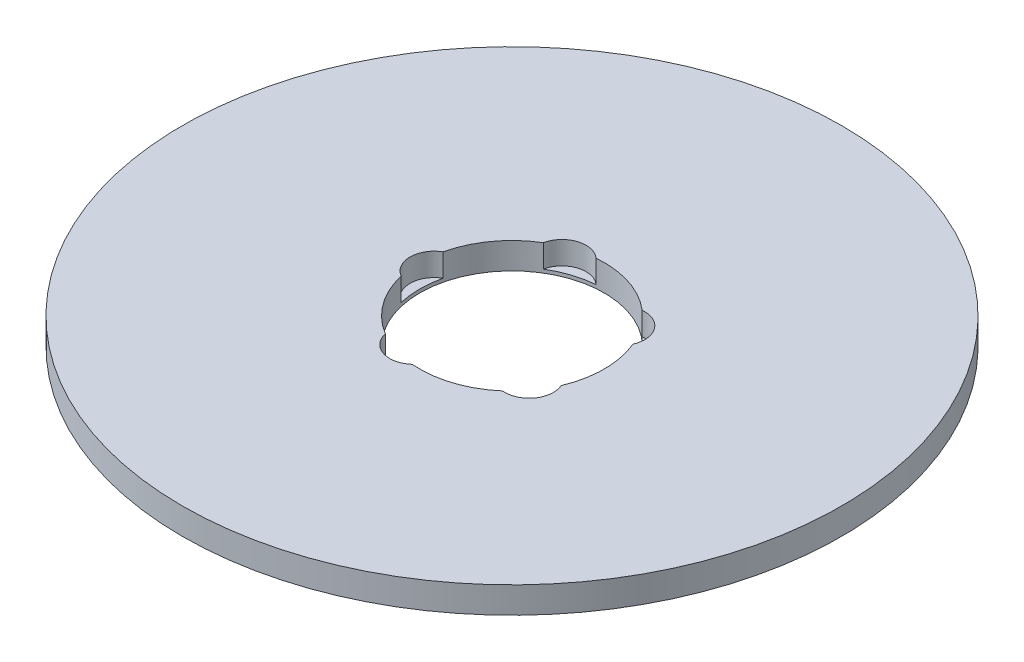
ISO-10303-21;
HEADER;
FILE_DESCRIPTION(('STEP AP214'),'2;1');
FILE_NAME('part.step','',(''),(''),'','','');
FILE_SCHEMA(('AUTOMOTIVE_DESIGN { 1 0 10303 214 1 1 1 1 }'));
ENDSEC;
DATA;
#1=APPLICATION_CONTEXT('core data for automotive mechanical design processes');
#2=APPLICATION_PROTOCOL_DEFINITION('international standard','automotive_design',2000,#1);
#3=PRODUCT_CONTEXT('',#1,'mechanical');
#4=PRODUCT('Part','Part','',(#3));
#5=PRODUCT_RELATED_PRODUCT_CATEGORY('part','',(#4));
#6=PRODUCT_DEFINITION_FORMATION('','',#4);
#7=PRODUCT_DEFINITION_CONTEXT('part definition',#1,'design');
#8=PRODUCT_DEFINITION('design','',#6,#7);
#9=PRODUCT_DEFINITION_SHAPE('','',#8);
#10=(LENGTH_UNIT() NAMED_UNIT(*) SI_UNIT(.MILLI.,.METRE.));
#11=(NAMED_UNIT(*) PLANE_ANGLE_UNIT() SI_UNIT($,.RADIAN.));
#12=(NAMED_UNIT(*) SI_UNIT($,.STERADIAN.) SOLID_ANGLE_UNIT());
#13=UNCERTAINTY_MEASURE_WITH_UNIT(LENGTH_MEASURE(1.E-05),#10,'distance_accuracy_value','');
#14=(GEOMETRIC_REPRESENTATION_CONTEXT(3) GLOBAL_UNCERTAINTY_ASSIGNED_CONTEXT((#13)) GLOBAL_UNIT_ASSIGNED_CONTEXT((#10,
#11,#12)) REPRESENTATION_CONTEXT('',''));
#15=CARTESIAN_POINT('',(0.,0.,0.));
#16=DIRECTION('',(0.,0.,1.));
#17=DIRECTION('',(1.,0.,0.));
#18=AXIS2_PLACEMENT_3D('',#15,#16,#17);
#19=CARTESIAN_POINT('',(0.,5.,0.));
#20=DIRECTION('',(0.,-1.,0.));
#21=DIRECTION('',(0.,0.,-1.));
#22=AXIS2_PLACEMENT_3D('',#19,#20,#21);
#23=CYLINDRICAL_SURFACE('',#22,62.5);
#24=CARTESIAN_POINT('',(0.,5.,0.));
#25=DIRECTION('',(0.,1.,0.));
#26=DIRECTION('',(0.,0.,1.));
#27=AXIS2_PLACEMENT_3D('',#24,#25,#26);
#28=CIRCLE('',#27,62.5);
#29=CARTESIAN_POINT('',(0.,5.,62.5));
#30=VERTEX_POINT('',#29);
#31=EDGE_CURVE('E151',#30,#30,#28,.T.);
#32=ORIENTED_EDGE('',*,*,#31,.F.);
#33=EDGE_LOOP('',(#32));
#34=FACE_BOUND('',#33,.T.);
#35=CARTESIAN_POINT('',(0.,0.,0.));
#36=DIRECTION('',(0.,1.,0.));
#37=DIRECTION('',(0.,0.,1.));
#38=AXIS2_PLACEMENT_3D('',#35,#36,#37);
#39=CIRCLE('',#38,62.5);
#40=CARTESIAN_POINT('',(0.,0.,62.5));
#41=VERTEX_POINT('',#40);
#42=EDGE_CURVE('E150',#41,#41,#39,.T.);
#43=ORIENTED_EDGE('',*,*,#42,.T.);
#44=EDGE_LOOP('',(#43));
#45=FACE_BOUND('',#44,.T.);
#46=ADVANCED_FACE('F39',(#34,#45),#23,.T.);
#47=CARTESIAN_POINT('',(0.,5.,0.));
#48=DIRECTION('',(0.,1.,0.));
#49=DIRECTION('',(0.,0.,1.));
#50=AXIS2_PLACEMENT_3D('',#47,#48,#49);
#51=PLANE('',#50);
#52=CARTESIAN_POINT('',(-4.55789758670267,5.,-14.0277663667251));
#53=DIRECTION('',(0.,1.,0.));
#54=DIRECTION('',(-0.95105651629515,0.,0.309016994374958));
#55=AXIS2_PLACEMENT_3D('',#52,#53,#54);
#56=CIRCLE('',#55,4.58566396211919);
#57=CARTESIAN_POINT('',(-1.49042088561762,5.,-17.4364172232634));
#58=VERTEX_POINT('',#57);
#59=CARTESIAN_POINT('',(-9.043093071417,5.,-14.9824052709066));
#60=VERTEX_POINT('',#59);
#61=EDGE_CURVE('E196',#58,#60,#56,.T.);
#62=ORIENTED_EDGE('',*,*,#61,.F.);
#63=CARTESIAN_POINT('',(0.,5.,0.));
#64=DIRECTION('',(0.,1.,0.));
#65=DIRECTION('',(0.,0.,1.));
#66=AXIS2_PLACEMENT_3D('',#63,#64,#65);
#67=CIRCLE('',#66,17.5);
#68=CARTESIAN_POINT('',(11.4546447218884,5.,-13.2303104383576));
#69=VERTEX_POINT('',#68);
#70=EDGE_CURVE('E156',#69,#58,#67,.T.);
#71=ORIENTED_EDGE('',*,*,#70,.F.);
#72=CARTESIAN_POINT('',(11.9327307992282,5.,-8.66963640087886));
#73=DIRECTION('',(0.,1.,0.));
#74=DIRECTION('',(-0.58778525229248,0.,-0.809016994374942));
#75=AXIS2_PLACEMENT_3D('',#72,#73,#74);
#76=CIRCLE('',#75,4.58566396211919);
#77=CARTESIAN_POINT('',(16.1224528385985,5.,-6.8056237382894));
#78=VERTEX_POINT('',#77);
#79=EDGE_CURVE('E254',#78,#69,#76,.T.);
#80=ORIENTED_EDGE('',*,*,#79,.F.);
#81=CARTESIAN_POINT('',(16.1224528385986,5.,6.80562373828917));
#82=VERTEX_POINT('',#81);
#83=EDGE_CURVE('E153',#82,#78,#67,.T.);
#84=ORIENTED_EDGE('',*,*,#83,.F.);
#85=CARTESIAN_POINT('',(11.9327307992283,5.,8.66963640087869));
#86=DIRECTION('',(0.,1.,0.));
#87=DIRECTION('',(0.587785252292469,0.,-0.809016994374951));
#88=AXIS2_PLACEMENT_3D('',#85,#86,#87);
#89=CIRCLE('',#88,4.58566396211919);
#90=CARTESIAN_POINT('',(11.4546447218886,5.,13.2303104383574));
#91=VERTEX_POINT('',#90);
#92=EDGE_CURVE('E248',#91,#82,#89,.T.);
#93=ORIENTED_EDGE('',*,*,#92,.F.);
#94=CARTESIAN_POINT('',(-1.49042088561737,5.,17.4364172232634));
#95=VERTEX_POINT('',#94);
#96=EDGE_CURVE('E140',#95,#91,#67,.T.);
#97=ORIENTED_EDGE('',*,*,#96,.F.);
#98=CARTESIAN_POINT('',(-4.55789758670247,5.,14.0277663667252));
#99=DIRECTION('',(0.,1.,0.));
#100=DIRECTION('',(0.951056516295155,0.,0.309016994374945));
#101=AXIS2_PLACEMENT_3D('',#98,#99,#100);
#102=CIRCLE('',#101,4.58566396211919);
#103=CARTESIAN_POINT('',(-9.04309307141679,5.,14.9824052709067));
#104=VERTEX_POINT('',#103);
#105=EDGE_CURVE('E117',#104,#95,#102,.T.);
#106=ORIENTED_EDGE('',*,*,#105,.F.);
#107=CARTESIAN_POINT('',(-17.0435836034528,5.,3.97067474771157));
#108=VERTEX_POINT('',#107);
#109=EDGE_CURVE('E133',#108,#104,#67,.T.);
#110=ORIENTED_EDGE('',*,*,#109,.F.);
#111=CARTESIAN_POINT('',(-14.7496664250516,5.,0.));
#112=DIRECTION('',(0.,1.,0.));
#113=DIRECTION('',(0.,0.,1.));
#114=AXIS2_PLACEMENT_3D('',#111,#112,#113);
#115=CIRCLE('',#114,4.58566396211919);
#116=CARTESIAN_POINT('',(-17.0435836034528,5.,-3.97067474771157));
#117=VERTEX_POINT('',#116);
#118=EDGE_CURVE('E170',#117,#108,#115,.T.);
#119=ORIENTED_EDGE('',*,*,#118,.F.);
#120=EDGE_CURVE('E149',#60,#117,#67,.T.);
#121=ORIENTED_EDGE('',*,*,#120,.F.);
#122=EDGE_LOOP('',(#62,#71,#80,#84,#93,#97,#106,#110,#119,#121));
#123=FACE_BOUND('',#122,.T.);
#124=ORIENTED_EDGE('',*,*,#31,.T.);
#125=EDGE_LOOP('',(#124));
#126=FACE_BOUND('',#125,.T.);
#127=ADVANCED_FACE('F131',(#123,#126),#51,.T.);
#128=CARTESIAN_POINT('',(0.,0.,0.));
#129=DIRECTION('',(0.,1.,0.));
#130=DIRECTION('',(0.,0.,1.));
#131=AXIS2_PLACEMENT_3D('',#128,#129,#130);
#132=PLANE('',#131);
#133=CARTESIAN_POINT('',(0.,0.,0.));
#134=DIRECTION('',(0.,1.,0.));
#135=DIRECTION('',(0.,0.,1.));
#136=AXIS2_PLACEMENT_3D('',#133,#134,#135);
#137=CIRCLE('',#136,17.5);
#138=CARTESIAN_POINT('',(0.,0.,17.5));
#139=VERTEX_POINT('',#138);
#140=EDGE_CURVE('E160',#139,#139,#137,.T.);
#141=ORIENTED_EDGE('',*,*,#140,.T.);
#142=EDGE_LOOP('',(#141));
#143=FACE_BOUND('',#142,.T.);
#144=ORIENTED_EDGE('',*,*,#42,.F.);
#145=EDGE_LOOP('',(#144));
#146=FACE_BOUND('',#145,.T.);
#147=ADVANCED_FACE('F212',(#143,#146),#132,.F.);
#148=CARTESIAN_POINT('',(0.,5.,0.));
#149=DIRECTION('',(0.,-1.,0.));
#150=DIRECTION('',(0.,0.,-1.));
#151=AXIS2_PLACEMENT_3D('',#148,#149,#150);
#152=CYLINDRICAL_SURFACE('',#151,17.5);
#153=DIRECTION('',(0.,1.,0.));
#154=VECTOR('',#153,1.);
#155=CARTESIAN_POINT('',(-1.49042088561762,2.82802596181678,-17.4364172232634));
#156=LINE('',#155,#154);
#157=CARTESIAN_POINT('',(-1.49042088561762,0.656051923633559,-17.4364172232634));
#158=VERTEX_POINT('',#157);
#159=EDGE_CURVE('E11',#158,#58,#156,.T.);
#160=ORIENTED_EDGE('',*,*,#159,.F.);
#161=CARTESIAN_POINT('',(0.,0.656051923633559,0.));
#162=DIRECTION('',(0.,1.,0.));
#163=DIRECTION('',(0.,0.,1.));
#164=AXIS2_PLACEMENT_3D('',#161,#162,#163);
#165=CIRCLE('',#164,17.5);
#166=CARTESIAN_POINT('',(-9.043093071417,0.656051923633559,-14.9824052709066));
#167=VERTEX_POINT('',#166);
#168=EDGE_CURVE('E193',#158,#167,#165,.T.);
#169=ORIENTED_EDGE('',*,*,#168,.T.);
#170=DIRECTION('',(0.,1.,0.));
#171=VECTOR('',#170,1.);
#172=CARTESIAN_POINT('',(-9.043093071417,2.82802596181678,-14.9824052709066));
#173=LINE('',#172,#171);
#174=EDGE_CURVE('E46',#60,#167,#173,.F.);
#175=ORIENTED_EDGE('',*,*,#174,.F.);
#176=ORIENTED_EDGE('',*,*,#120,.T.);
#177=DIRECTION('',(0.,1.,0.));
#178=VECTOR('',#177,1.);
#179=CARTESIAN_POINT('',(-17.0435836034528,2.82802596181678,-3.97067474771157));
#180=LINE('',#179,#178);
#181=CARTESIAN_POINT('',(-17.0435836034528,0.656051923633559,-3.97067474771157));
#182=VERTEX_POINT('',#181);
#183=EDGE_CURVE('E174',#182,#117,#180,.T.);
#184=ORIENTED_EDGE('',*,*,#183,.F.);
#185=CARTESIAN_POINT('',(0.,0.656051923633559,0.));
#186=DIRECTION('',(0.,1.,0.));
#187=DIRECTION('',(0.,0.,1.));
#188=AXIS2_PLACEMENT_3D('',#185,#186,#187);
#189=CIRCLE('',#188,17.5);
#190=CARTESIAN_POINT('',(-17.0435836034528,0.656051923633559,3.97067474771157));
#191=VERTEX_POINT('',#190);
#192=EDGE_CURVE('E171',#182,#191,#189,.T.);
#193=ORIENTED_EDGE('',*,*,#192,.T.);
#194=DIRECTION('',(0.,1.,0.));
#195=VECTOR('',#194,1.);
#196=CARTESIAN_POINT('',(-17.0435836034528,2.82802596181678,3.97067474771157));
#197=LINE('',#196,#195);
#198=EDGE_CURVE('E148',#108,#191,#197,.F.);
#199=ORIENTED_EDGE('',*,*,#198,.F.);
#200=ORIENTED_EDGE('',*,*,#109,.T.);
#201=DIRECTION('',(0.,1.,0.));
#202=VECTOR('',#201,1.);
#203=CARTESIAN_POINT('',(-9.04309307141679,2.82802596181678,14.9824052709067));
#204=LINE('',#203,#202);
#205=CARTESIAN_POINT('',(-9.04309307141679,0.656051923633559,14.9824052709067));
#206=VERTEX_POINT('',#205);
#207=EDGE_CURVE('E111',#206,#104,#204,.T.);
#208=ORIENTED_EDGE('',*,*,#207,.F.);
#209=CARTESIAN_POINT('',(0.,0.656051923633559,0.));
#210=DIRECTION('',(0.,1.,0.));
#211=DIRECTION('',(0.,0.,1.));
#212=AXIS2_PLACEMENT_3D('',#209,#210,#211);
#213=CIRCLE('',#212,17.5);
#214=CARTESIAN_POINT('',(-1.49042088561737,0.656051923633559,17.4364172232634));
#215=VERTEX_POINT('',#214);
#216=EDGE_CURVE('E180',#206,#215,#213,.T.);
#217=ORIENTED_EDGE('',*,*,#216,.T.);
#218=DIRECTION('',(0.,1.,0.));
#219=VECTOR('',#218,1.);
#220=CARTESIAN_POINT('',(-1.49042088561737,2.82802596181678,17.4364172232634));
#221=LINE('',#220,#219);
#222=EDGE_CURVE('E124',#95,#215,#221,.F.);
#223=ORIENTED_EDGE('',*,*,#222,.F.);
#224=ORIENTED_EDGE('',*,*,#96,.T.);
#225=DIRECTION('',(0.,1.,0.));
#226=VECTOR('',#225,1.);
#227=CARTESIAN_POINT('',(11.4546447218886,2.82802596181678,13.2303104383574));
#228=LINE('',#227,#226);
#229=CARTESIAN_POINT('',(11.4546447218886,0.656051923633559,13.2303104383574));
#230=VERTEX_POINT('',#229);
#231=EDGE_CURVE('E183',#230,#91,#228,.T.);
#232=ORIENTED_EDGE('',*,*,#231,.F.);
#233=CARTESIAN_POINT('',(0.,0.656051923633559,0.));
#234=DIRECTION('',(0.,1.,0.));
#235=DIRECTION('',(0.,0.,1.));
#236=AXIS2_PLACEMENT_3D('',#233,#234,#235);
#237=CIRCLE('',#236,17.5);
#238=CARTESIAN_POINT('',(16.1224528385986,0.656051923633559,6.80562373828917));
#239=VERTEX_POINT('',#238);
#240=EDGE_CURVE('E123',#230,#239,#237,.T.);
#241=ORIENTED_EDGE('',*,*,#240,.T.);
#242=DIRECTION('',(0.,1.,0.));
#243=VECTOR('',#242,1.);
#244=CARTESIAN_POINT('',(16.1224528385986,2.82802596181678,6.80562373828917));
#245=LINE('',#244,#243);
#246=EDGE_CURVE('E185',#82,#239,#245,.F.);
#247=ORIENTED_EDGE('',*,*,#246,.F.);
#248=ORIENTED_EDGE('',*,*,#83,.T.);
#249=DIRECTION('',(0.,1.,0.));
#250=VECTOR('',#249,1.);
#251=CARTESIAN_POINT('',(16.1224528385985,2.82802596181678,-6.80562373828941));
#252=LINE('',#251,#250);
#253=CARTESIAN_POINT('',(16.1224528385985,0.656051923633559,-6.8056237382894));
#254=VERTEX_POINT('',#253);
#255=EDGE_CURVE('E195',#254,#78,#252,.T.);
#256=ORIENTED_EDGE('',*,*,#255,.F.);
#257=CARTESIAN_POINT('',(0.,0.656051923633559,0.));
#258=DIRECTION('',(0.,1.,0.));
#259=DIRECTION('',(0.,0.,1.));
#260=AXIS2_PLACEMENT_3D('',#257,#258,#259);
#261=CIRCLE('',#260,17.5);
#262=CARTESIAN_POINT('',(11.4546447218884,0.656051923633559,-13.2303104383576));
#263=VERTEX_POINT('',#262);
#264=EDGE_CURVE('E190',#254,#263,#261,.T.);
#265=ORIENTED_EDGE('',*,*,#264,.T.);
#266=DIRECTION('',(0.,1.,0.));
#267=VECTOR('',#266,1.);
#268=CARTESIAN_POINT('',(11.4546447218884,2.82802596181678,-13.2303104383576));
#269=LINE('',#268,#267);
#270=EDGE_CURVE('E189',#69,#263,#269,.F.);
#271=ORIENTED_EDGE('',*,*,#270,.F.);
#272=ORIENTED_EDGE('',*,*,#70,.T.);
#273=EDGE_LOOP('',(#160,#169,#175,#176,#184,#193,#199,#200,#208,#217,#223,#224,#232,#241,#247,
#248,#256,#265,#271,#272));
#274=FACE_BOUND('',#273,.T.);
#275=ORIENTED_EDGE('',*,*,#140,.F.);
#276=EDGE_LOOP('',(#275));
#277=FACE_BOUND('',#276,.T.);
#278=ADVANCED_FACE('F142',(#274,#277),#152,.F.);
#279=CARTESIAN_POINT('',(-14.7496664250516,0.656051923633559,0.));
#280=DIRECTION('',(0.,1.,0.));
#281=DIRECTION('',(0.,0.,1.));
#282=AXIS2_PLACEMENT_3D('',#279,#280,#281);
#283=CYLINDRICAL_SURFACE('',#282,4.58566396211919);
#284=ORIENTED_EDGE('',*,*,#183,.T.);
#285=ORIENTED_EDGE('',*,*,#118,.T.);
#286=ORIENTED_EDGE('',*,*,#198,.T.);
#287=CARTESIAN_POINT('',(-14.7496664250516,0.656051923633559,0.));
#288=DIRECTION('',(0.,1.,0.));
#289=DIRECTION('',(0.,0.,1.));
#290=AXIS2_PLACEMENT_3D('',#287,#288,#289);
#291=CIRCLE('',#290,4.58566396211919);
#292=EDGE_CURVE('E163',#182,#191,#291,.T.);
#293=ORIENTED_EDGE('',*,*,#292,.F.);
#294=EDGE_LOOP('',(#284,#285,#286,#293));
#295=FACE_BOUND('',#294,.T.);
#296=ADVANCED_FACE('F221',(#295),#283,.F.);
#297=CARTESIAN_POINT('',(-14.7496664250516,0.656051923633559,0.));
#298=DIRECTION('',(0.,1.,0.));
#299=DIRECTION('',(0.,0.,1.));
#300=AXIS2_PLACEMENT_3D('',#297,#298,#299);
#301=PLANE('',#300);
#302=ORIENTED_EDGE('',*,*,#292,.T.);
#303=ORIENTED_EDGE('',*,*,#192,.F.);
#304=EDGE_LOOP('',(#302,#303));
#305=FACE_BOUND('',#304,.T.);
#306=ADVANCED_FACE('F227',(#305),#301,.T.);
#307=CARTESIAN_POINT('',(-4.55789758670247,0.656051923633559,14.0277663667252));
#308=DIRECTION('',(0.,1.,0.));
#309=DIRECTION('',(0.,0.,1.));
#310=AXIS2_PLACEMENT_3D('',#307,#308,#309);
#311=CYLINDRICAL_SURFACE('',#310,4.58566396211919);
#312=ORIENTED_EDGE('',*,*,#207,.T.);
#313=ORIENTED_EDGE('',*,*,#105,.T.);
#314=ORIENTED_EDGE('',*,*,#222,.T.);
#315=CARTESIAN_POINT('',(-4.55789758670247,0.656051923633559,14.0277663667252));
#316=DIRECTION('',(0.,1.,0.));
#317=DIRECTION('',(0.951056516295155,0.,0.309016994374945));
#318=AXIS2_PLACEMENT_3D('',#315,#316,#317);
#319=CIRCLE('',#318,4.58566396211919);
#320=EDGE_CURVE('E119',#206,#215,#319,.T.);
#321=ORIENTED_EDGE('',*,*,#320,.F.);
#322=EDGE_LOOP('',(#312,#313,#314,#321));
#323=FACE_BOUND('',#322,.T.);
#324=ADVANCED_FACE('F116',(#323),#311,.F.);
#325=CARTESIAN_POINT('',(-4.55789758670247,0.656051923633559,14.0277663667252));
#326=DIRECTION('',(0.,1.,0.));
#327=DIRECTION('',(0.951056516295155,0.,0.309016994374945));
#328=AXIS2_PLACEMENT_3D('',#325,#326,#327);
#329=PLANE('',#328);
#330=ORIENTED_EDGE('',*,*,#320,.T.);
#331=ORIENTED_EDGE('',*,*,#216,.F.);
#332=EDGE_LOOP('',(#330,#331));
#333=FACE_BOUND('',#332,.T.);
#334=ADVANCED_FACE('F234',(#333),#329,.T.);
#335=CARTESIAN_POINT('',(11.9327307992283,0.656051923633559,8.66963640087869));
#336=DIRECTION('',(0.,1.,0.));
#337=DIRECTION('',(0.,0.,1.));
#338=AXIS2_PLACEMENT_3D('',#335,#336,#337);
#339=CYLINDRICAL_SURFACE('',#338,4.58566396211919);
#340=ORIENTED_EDGE('',*,*,#231,.T.);
#341=ORIENTED_EDGE('',*,*,#92,.T.);
#342=ORIENTED_EDGE('',*,*,#246,.T.);
#343=CARTESIAN_POINT('',(11.9327307992283,0.656051923633559,8.66963640087869));
#344=DIRECTION('',(0.,1.,0.));
#345=DIRECTION('',(0.587785252292469,0.,-0.809016994374951));
#346=AXIS2_PLACEMENT_3D('',#343,#344,#345);
#347=CIRCLE('',#346,4.58566396211919);
#348=EDGE_CURVE('E137',#230,#239,#347,.T.);
#349=ORIENTED_EDGE('',*,*,#348,.F.);
#350=EDGE_LOOP('',(#340,#341,#342,#349));
#351=FACE_BOUND('',#350,.T.);
#352=ADVANCED_FACE('F240',(#351),#339,.F.);
#353=CARTESIAN_POINT('',(11.9327307992283,0.656051923633559,8.66963640087869));
#354=DIRECTION('',(0.,1.,0.));
#355=DIRECTION('',(0.587785252292469,0.,-0.809016994374951));
#356=AXIS2_PLACEMENT_3D('',#353,#354,#355);
#357=PLANE('',#356);
#358=ORIENTED_EDGE('',*,*,#348,.T.);
#359=ORIENTED_EDGE('',*,*,#240,.F.);
#360=EDGE_LOOP('',(#358,#359));
#361=FACE_BOUND('',#360,.T.);
#362=ADVANCED_FACE('F245',(#361),#357,.T.);
#363=CARTESIAN_POINT('',(11.9327307992282,0.656051923633559,-8.66963640087886));
#364=DIRECTION('',(0.,1.,0.));
#365=DIRECTION('',(0.,0.,1.));
#366=AXIS2_PLACEMENT_3D('',#363,#364,#365);
#367=CYLINDRICAL_SURFACE('',#366,4.58566396211919);
#368=ORIENTED_EDGE('',*,*,#255,.T.);
#369=ORIENTED_EDGE('',*,*,#79,.T.);
#370=ORIENTED_EDGE('',*,*,#270,.T.);
#371=CARTESIAN_POINT('',(11.9327307992282,0.656051923633559,-8.66963640087886));
#372=DIRECTION('',(0.,1.,0.));
#373=DIRECTION('',(-0.58778525229248,0.,-0.809016994374942));
#374=AXIS2_PLACEMENT_3D('',#371,#372,#373);
#375=CIRCLE('',#374,4.58566396211919);
#376=EDGE_CURVE('E56',#254,#263,#375,.T.);
#377=ORIENTED_EDGE('',*,*,#376,.F.);
#378=EDGE_LOOP('',(#368,#369,#370,#377));
#379=FACE_BOUND('',#378,.T.);
#380=ADVANCED_FACE('F264',(#379),#367,.F.);
#381=CARTESIAN_POINT('',(11.9327307992282,0.656051923633559,-8.66963640087886));
#382=DIRECTION('',(0.,1.,0.));
#383=DIRECTION('',(-0.58778525229248,0.,-0.809016994374942));
#384=AXIS2_PLACEMENT_3D('',#381,#382,#383);
#385=PLANE('',#384);
#386=ORIENTED_EDGE('',*,*,#376,.T.);
#387=ORIENTED_EDGE('',*,*,#264,.F.);
#388=EDGE_LOOP('',(#386,#387));
#389=FACE_BOUND('',#388,.T.);
#390=ADVANCED_FACE('F202',(#389),#385,.T.);
#391=CARTESIAN_POINT('',(-4.55789758670267,0.656051923633559,-14.0277663667251));
#392=DIRECTION('',(0.,1.,0.));
#393=DIRECTION('',(0.,0.,1.));
#394=AXIS2_PLACEMENT_3D('',#391,#392,#393);
#395=CYLINDRICAL_SURFACE('',#394,4.58566396211919);
#396=ORIENTED_EDGE('',*,*,#159,.T.);
#397=ORIENTED_EDGE('',*,*,#61,.T.);
#398=ORIENTED_EDGE('',*,*,#174,.T.);
#399=CARTESIAN_POINT('',(-4.55789758670267,0.656051923633559,-14.0277663667251));
#400=DIRECTION('',(0.,1.,0.));
#401=DIRECTION('',(-0.95105651629515,0.,0.309016994374958));
#402=AXIS2_PLACEMENT_3D('',#399,#400,#401);
#403=CIRCLE('',#402,4.58566396211919);
#404=EDGE_CURVE('E55',#158,#167,#403,.T.);
#405=ORIENTED_EDGE('',*,*,#404,.F.);
#406=EDGE_LOOP('',(#396,#397,#398,#405));
#407=FACE_BOUND('',#406,.T.);
#408=ADVANCED_FACE('F197',(#407),#395,.F.);
#409=CARTESIAN_POINT('',(-4.55789758670267,0.656051923633559,-14.0277663667251));
#410=DIRECTION('',(0.,1.,0.));
#411=DIRECTION('',(-0.95105651629515,0.,0.309016994374958));
#412=AXIS2_PLACEMENT_3D('',#409,#410,#411);
#413=PLANE('',#412);
#414=ORIENTED_EDGE('',*,*,#404,.T.);
#415=ORIENTED_EDGE('',*,*,#168,.F.);
#416=EDGE_LOOP('',(#414,#415));
#417=FACE_BOUND('',#416,.T.);
#418=ADVANCED_FACE('F200',(#417),#413,.T.);
#419=CLOSED_SHELL('',(#46,#127,#147,#278,#296,#306,#324,#334,#352,#362,#380,#390,#408,#418));
#420=MANIFOLD_SOLID_BREP('B2',#419);
#421=ADVANCED_BREP_SHAPE_REPRESENTATION('',(#18,#420),#14);
#422=SHAPE_DEFINITION_REPRESENTATION(#9,#421);
ENDSEC;
END-ISO-10303-21;
